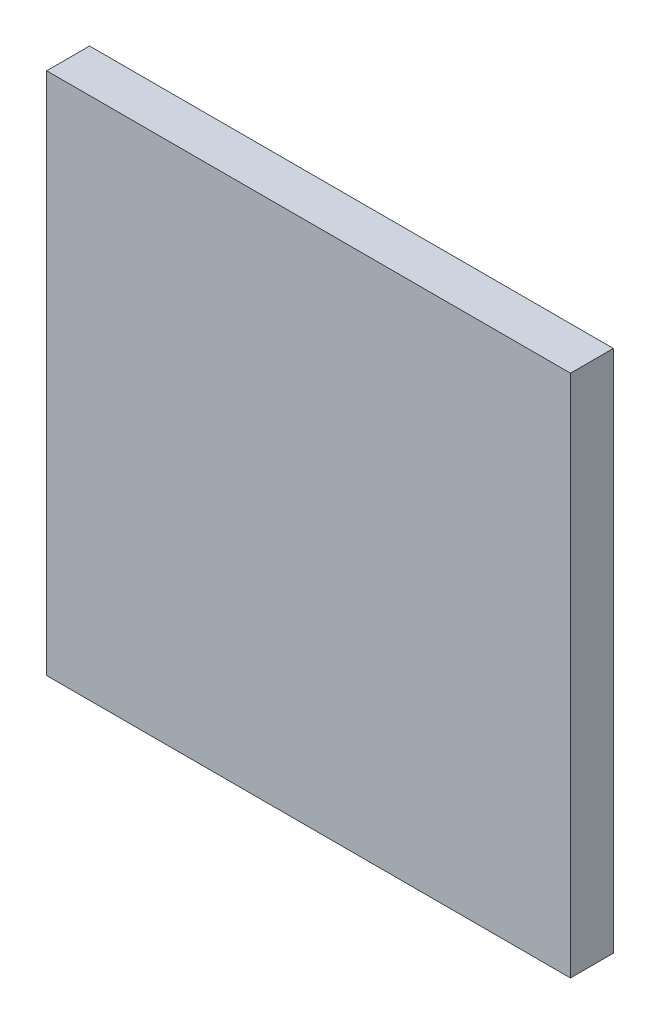
ISO-10303-21;
HEADER;
FILE_DESCRIPTION(('STEP AP214'),'2;1');
FILE_NAME('part.step','',(''),(''),'','','');
FILE_SCHEMA(('AUTOMOTIVE_DESIGN { 1 0 10303 214 1 1 1 1 }'));
ENDSEC;
DATA;
#1=APPLICATION_CONTEXT('core data for automotive mechanical design processes');
#2=APPLICATION_PROTOCOL_DEFINITION('international standard','automotive_design',2000,#1);
#3=PRODUCT_CONTEXT('',#1,'mechanical');
#4=PRODUCT('Part','Part','',(#3));
#5=PRODUCT_RELATED_PRODUCT_CATEGORY('part','',(#4));
#6=PRODUCT_DEFINITION_FORMATION('','',#4);
#7=PRODUCT_DEFINITION_CONTEXT('part definition',#1,'design');
#8=PRODUCT_DEFINITION('design','',#6,#7);
#9=PRODUCT_DEFINITION_SHAPE('','',#8);
#10=(LENGTH_UNIT() NAMED_UNIT(*) SI_UNIT(.MILLI.,.METRE.));
#11=(NAMED_UNIT(*) PLANE_ANGLE_UNIT() SI_UNIT($,.RADIAN.));
#12=(NAMED_UNIT(*) SI_UNIT($,.STERADIAN.) SOLID_ANGLE_UNIT());
#13=UNCERTAINTY_MEASURE_WITH_UNIT(LENGTH_MEASURE(1.E-05),#10,'distance_accuracy_value','');
#14=(GEOMETRIC_REPRESENTATION_CONTEXT(3) GLOBAL_UNCERTAINTY_ASSIGNED_CONTEXT((#13)) GLOBAL_UNIT_ASSIGNED_CONTEXT((#10,
#11,#12)) REPRESENTATION_CONTEXT('',''));
#15=CARTESIAN_POINT('',(0.,0.,0.));
#16=DIRECTION('',(0.,0.,1.));
#17=DIRECTION('',(1.,0.,0.));
#18=AXIS2_PLACEMENT_3D('',#15,#16,#17);
#19=CARTESIAN_POINT('',(28.1,-28.1,4.6));
#20=DIRECTION('',(-1.,0.,0.));
#21=DIRECTION('',(0.,0.,1.));
#22=AXIS2_PLACEMENT_3D('',#19,#20,#21);
#23=PLANE('',#22);
#24=DIRECTION('',(0.,1.,0.));
#25=VECTOR('',#24,1.);
#26=CARTESIAN_POINT('',(28.1,-28.1,0.));
#27=LINE('',#26,#25);
#28=CARTESIAN_POINT('',(28.1,-28.1,0.));
#29=VERTEX_POINT('',#28);
#30=CARTESIAN_POINT('',(28.1,28.1,0.));
#31=VERTEX_POINT('',#30);
#32=EDGE_CURVE('E93',#29,#31,#27,.T.);
#33=ORIENTED_EDGE('',*,*,#32,.T.);
#34=DIRECTION('',(0.,0.,-1.));
#35=VECTOR('',#34,1.);
#36=CARTESIAN_POINT('',(28.1,28.1,4.6));
#37=LINE('',#36,#35);
#38=CARTESIAN_POINT('',(28.1,28.1,4.6));
#39=VERTEX_POINT('',#38);
#40=EDGE_CURVE('E11',#39,#31,#37,.T.);
#41=ORIENTED_EDGE('',*,*,#40,.F.);
#42=DIRECTION('',(0.,1.,0.));
#43=VECTOR('',#42,1.);
#44=CARTESIAN_POINT('',(28.1,-28.1,4.6));
#45=LINE('',#44,#43);
#46=CARTESIAN_POINT('',(28.1,-28.1,4.6));
#47=VERTEX_POINT('',#46);
#48=EDGE_CURVE('E81',#47,#39,#45,.T.);
#49=ORIENTED_EDGE('',*,*,#48,.F.);
#50=DIRECTION('',(0.,0.,-1.));
#51=VECTOR('',#50,1.);
#52=CARTESIAN_POINT('',(28.1,-28.1,4.6));
#53=LINE('',#52,#51);
#54=EDGE_CURVE('E89',#47,#29,#53,.T.);
#55=ORIENTED_EDGE('',*,*,#54,.T.);
#56=EDGE_LOOP('',(#33,#41,#49,#55));
#57=FACE_BOUND('',#56,.T.);
#58=ADVANCED_FACE('F30',(#57),#23,.F.);
#59=CARTESIAN_POINT('',(-28.1,28.1,4.6));
#60=DIRECTION('',(0.,-1.,0.));
#61=DIRECTION('',(0.,0.,-1.));
#62=AXIS2_PLACEMENT_3D('',#59,#60,#61);
#63=PLANE('',#62);
#64=DIRECTION('',(-1.,0.,0.));
#65=VECTOR('',#64,1.);
#66=CARTESIAN_POINT('',(-28.1,28.1,0.));
#67=LINE('',#66,#65);
#68=CARTESIAN_POINT('',(-28.1,28.1,0.));
#69=VERTEX_POINT('',#68);
#70=EDGE_CURVE('E85',#31,#69,#67,.T.);
#71=ORIENTED_EDGE('',*,*,#70,.T.);
#72=DIRECTION('',(0.,0.,-1.));
#73=VECTOR('',#72,1.);
#74=CARTESIAN_POINT('',(-28.1,28.1,4.6));
#75=LINE('',#74,#73);
#76=CARTESIAN_POINT('',(-28.1,28.1,4.6));
#77=VERTEX_POINT('',#76);
#78=EDGE_CURVE('E38',#77,#69,#75,.T.);
#79=ORIENTED_EDGE('',*,*,#78,.F.);
#80=DIRECTION('',(-1.,0.,0.));
#81=VECTOR('',#80,1.);
#82=CARTESIAN_POINT('',(-28.1,28.1,4.6));
#83=LINE('',#82,#81);
#84=EDGE_CURVE('E76',#39,#77,#83,.T.);
#85=ORIENTED_EDGE('',*,*,#84,.F.);
#86=ORIENTED_EDGE('',*,*,#40,.T.);
#87=EDGE_LOOP('',(#71,#79,#85,#86));
#88=FACE_BOUND('',#87,.T.);
#89=ADVANCED_FACE('F84',(#88),#63,.F.);
#90=CARTESIAN_POINT('',(-28.1,-28.1,4.6));
#91=DIRECTION('',(1.,0.,0.));
#92=DIRECTION('',(0.,0.,-1.));
#93=AXIS2_PLACEMENT_3D('',#90,#91,#92);
#94=PLANE('',#93);
#95=DIRECTION('',(0.,-1.,0.));
#96=VECTOR('',#95,1.);
#97=CARTESIAN_POINT('',(-28.1,-28.1,0.));
#98=LINE('',#97,#96);
#99=CARTESIAN_POINT('',(-28.1,-28.1,0.));
#100=VERTEX_POINT('',#99);
#101=EDGE_CURVE('E63',#69,#100,#98,.T.);
#102=ORIENTED_EDGE('',*,*,#101,.T.);
#103=DIRECTION('',(0.,0.,-1.));
#104=VECTOR('',#103,1.);
#105=CARTESIAN_POINT('',(-28.1,-28.1,4.6));
#106=LINE('',#105,#104);
#107=CARTESIAN_POINT('',(-28.1,-28.1,4.6));
#108=VERTEX_POINT('',#107);
#109=EDGE_CURVE('E86',#108,#100,#106,.T.);
#110=ORIENTED_EDGE('',*,*,#109,.F.);
#111=DIRECTION('',(0.,-1.,0.));
#112=VECTOR('',#111,1.);
#113=CARTESIAN_POINT('',(-28.1,-28.1,4.6));
#114=LINE('',#113,#112);
#115=EDGE_CURVE('E79',#77,#108,#114,.T.);
#116=ORIENTED_EDGE('',*,*,#115,.F.);
#117=ORIENTED_EDGE('',*,*,#78,.T.);
#118=EDGE_LOOP('',(#102,#110,#116,#117));
#119=FACE_BOUND('',#118,.T.);
#120=ADVANCED_FACE('F87',(#119),#94,.F.);
#121=CARTESIAN_POINT('',(-28.1,-28.1,4.6));
#122=DIRECTION('',(0.,1.,0.));
#123=DIRECTION('',(0.,0.,1.));
#124=AXIS2_PLACEMENT_3D('',#121,#122,#123);
#125=PLANE('',#124);
#126=DIRECTION('',(1.,0.,0.));
#127=VECTOR('',#126,1.);
#128=CARTESIAN_POINT('',(-28.1,-28.1,0.));
#129=LINE('',#128,#127);
#130=EDGE_CURVE('E69',#100,#29,#129,.T.);
#131=ORIENTED_EDGE('',*,*,#130,.T.);
#132=ORIENTED_EDGE('',*,*,#54,.F.);
#133=DIRECTION('',(1.,0.,0.));
#134=VECTOR('',#133,1.);
#135=CARTESIAN_POINT('',(-28.1,-28.1,4.6));
#136=LINE('',#135,#134);
#137=EDGE_CURVE('E46',#108,#47,#136,.T.);
#138=ORIENTED_EDGE('',*,*,#137,.F.);
#139=ORIENTED_EDGE('',*,*,#109,.T.);
#140=EDGE_LOOP('',(#131,#132,#138,#139));
#141=FACE_BOUND('',#140,.T.);
#142=ADVANCED_FACE('F100',(#141),#125,.F.);
#143=CARTESIAN_POINT('',(28.1,28.1,4.6));
#144=DIRECTION('',(0.,0.,-1.));
#145=DIRECTION('',(-1.,0.,0.));
#146=AXIS2_PLACEMENT_3D('',#143,#144,#145);
#147=PLANE('',#146);
#148=ORIENTED_EDGE('',*,*,#48,.T.);
#149=ORIENTED_EDGE('',*,*,#84,.T.);
#150=ORIENTED_EDGE('',*,*,#115,.T.);
#151=ORIENTED_EDGE('',*,*,#137,.T.);
#152=EDGE_LOOP('',(#148,#149,#150,#151));
#153=FACE_BOUND('',#152,.T.);
#154=ADVANCED_FACE('F77',(#153),#147,.F.);
#155=CARTESIAN_POINT('',(28.1,28.1,0.));
#156=DIRECTION('',(0.,0.,-1.));
#157=DIRECTION('',(-1.,0.,0.));
#158=AXIS2_PLACEMENT_3D('',#155,#156,#157);
#159=PLANE('',#158);
#160=ORIENTED_EDGE('',*,*,#32,.F.);
#161=ORIENTED_EDGE('',*,*,#130,.F.);
#162=ORIENTED_EDGE('',*,*,#101,.F.);
#163=ORIENTED_EDGE('',*,*,#70,.F.);
#164=EDGE_LOOP('',(#160,#161,#162,#163));
#165=FACE_BOUND('',#164,.T.);
#166=ADVANCED_FACE('F103',(#165),#159,.T.);
#167=CLOSED_SHELL('',(#58,#89,#120,#142,#154,#166));
#168=MANIFOLD_SOLID_BREP('B2',#167);
#169=ADVANCED_BREP_SHAPE_REPRESENTATION('',(#18,#168),#14);
#170=SHAPE_DEFINITION_REPRESENTATION(#9,#169);
ENDSEC;
END-ISO-10303-21;
